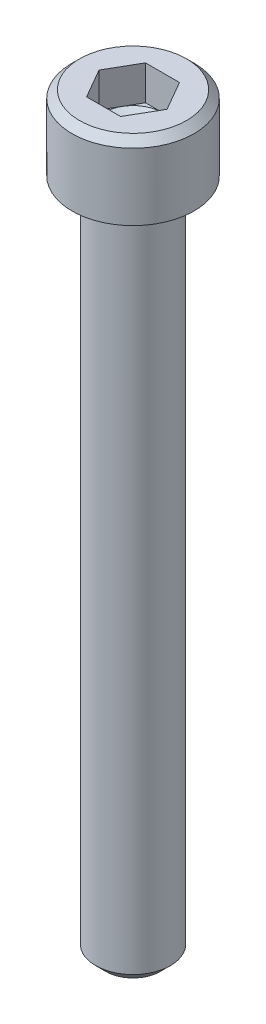
ISO-10303-21;
HEADER;
FILE_DESCRIPTION(('STEP AP214'),'2;1');
FILE_NAME('part.step','',(''),(''),'','','');
FILE_SCHEMA(('AUTOMOTIVE_DESIGN { 1 0 10303 214 1 1 1 1 }'));
ENDSEC;
DATA;
#1=APPLICATION_CONTEXT('core data for automotive mechanical design processes');
#2=APPLICATION_PROTOCOL_DEFINITION('international standard','automotive_design',2000,#1);
#3=PRODUCT_CONTEXT('',#1,'mechanical');
#4=PRODUCT('Part','Part','',(#3));
#5=PRODUCT_RELATED_PRODUCT_CATEGORY('part','',(#4));
#6=PRODUCT_DEFINITION_FORMATION('','',#4);
#7=PRODUCT_DEFINITION_CONTEXT('part definition',#1,'design');
#8=PRODUCT_DEFINITION('design','',#6,#7);
#9=PRODUCT_DEFINITION_SHAPE('','',#8);
#10=(LENGTH_UNIT() NAMED_UNIT(*) SI_UNIT(.MILLI.,.METRE.));
#11=(NAMED_UNIT(*) PLANE_ANGLE_UNIT() SI_UNIT($,.RADIAN.));
#12=(NAMED_UNIT(*) SI_UNIT($,.STERADIAN.) SOLID_ANGLE_UNIT());
#13=UNCERTAINTY_MEASURE_WITH_UNIT(LENGTH_MEASURE(1.E-05),#10,'distance_accuracy_value','');
#14=(GEOMETRIC_REPRESENTATION_CONTEXT(3) GLOBAL_UNCERTAINTY_ASSIGNED_CONTEXT((#13)) GLOBAL_UNIT_ASSIGNED_CONTEXT((#10,
#11,#12)) REPRESENTATION_CONTEXT('',''));
#15=CARTESIAN_POINT('',(0.,0.,0.));
#16=DIRECTION('',(0.,0.,1.));
#17=DIRECTION('',(1.,0.,0.));
#18=AXIS2_PLACEMENT_3D('',#15,#16,#17);
#19=CARTESIAN_POINT('',(0.,1.87960000005205,0.));
#20=DIRECTION('',(0.,1.,0.));
#21=DIRECTION('',(0.,0.,1.));
#22=AXIS2_PLACEMENT_3D('',#19,#20,#21);
#23=CONICAL_SURFACE('',#22,1.38430000009748,1.04719755120119);
#24=CARTESIAN_POINT('',(0.,1.08037402233663,5.6843418860808E-11));
#25=VERTEX_POINT('',#24);
#26=VERTEX_LOOP('',#25);
#27=FACE_BOUND('',#26,.T.);
#28=CARTESIAN_POINT('',(0.,1.87959999992078,0.));
#29=DIRECTION('',(0.,1.,0.));
#30=DIRECTION('',(0.,0.,1.));
#31=AXIS2_PLACEMENT_3D('',#28,#29,#30);
#32=CIRCLE('',#31,1.38429999987011);
#33=CARTESIAN_POINT('',(0.,1.87959999996039,-1.38429999993505));
#34=VERTEX_POINT('',#33);
#35=CARTESIAN_POINT('',(1.1988389664588,1.87959999996039,-0.692149999999999));
#36=VERTEX_POINT('',#35);
#37=EDGE_CURVE('E120',#34,#36,#32,.F.);
#38=ORIENTED_EDGE('',*,*,#37,.F.);
#39=CARTESIAN_POINT('',(0.,1.87959999998641,0.));
#40=DIRECTION('',(0.,1.,0.));
#41=DIRECTION('',(0.,0.,1.));
#42=AXIS2_PLACEMENT_3D('',#39,#40,#41);
#43=CIRCLE('',#42,1.3842999999838);
#44=CARTESIAN_POINT('',(-1.19883896645178,1.87959999999321,-0.692149999995952));
#45=VERTEX_POINT('',#44);
#46=EDGE_CURVE('E158',#45,#34,#43,.F.);
#47=ORIENTED_EDGE('',*,*,#46,.F.);
#48=CARTESIAN_POINT('',(0.,1.87959999998641,0.));
#49=DIRECTION('',(0.,1.,0.));
#50=DIRECTION('',(0.,0.,1.));
#51=AXIS2_PLACEMENT_3D('',#48,#49,#50);
#52=CIRCLE('',#51,1.3842999999838);
#53=CARTESIAN_POINT('',(-1.19883896645178,1.87960000001923,0.692149999995948));
#54=VERTEX_POINT('',#53);
#55=EDGE_CURVE('E155',#54,#45,#52,.F.);
#56=ORIENTED_EDGE('',*,*,#55,.F.);
#57=CARTESIAN_POINT('',(0.,1.87960000005205,0.));
#58=DIRECTION('',(0.,1.,0.));
#59=DIRECTION('',(0.,0.,1.));
#60=AXIS2_PLACEMENT_3D('',#57,#58,#59);
#61=CIRCLE('',#60,1.38430000009748);
#62=CARTESIAN_POINT('',(0.,1.87960000001923,1.38430000004064));
#63=VERTEX_POINT('',#62);
#64=EDGE_CURVE('E99',#63,#54,#61,.F.);
#65=ORIENTED_EDGE('',*,*,#64,.F.);
#66=CARTESIAN_POINT('',(0.,1.87959999998641,0.));
#67=DIRECTION('',(0.,1.,0.));
#68=DIRECTION('',(0.,0.,1.));
#69=AXIS2_PLACEMENT_3D('',#66,#67,#68);
#70=CIRCLE('',#69,1.3842999999838);
#71=CARTESIAN_POINT('',(1.19883896645178,1.87959999999321,0.692149999995949));
#72=VERTEX_POINT('',#71);
#73=EDGE_CURVE('E93',#72,#63,#70,.F.);
#74=ORIENTED_EDGE('',*,*,#73,.F.);
#75=CARTESIAN_POINT('',(0.,1.87959999998641,0.));
#76=DIRECTION('',(0.,1.,0.));
#77=DIRECTION('',(0.,0.,1.));
#78=AXIS2_PLACEMENT_3D('',#75,#76,#77);
#79=CIRCLE('',#78,1.3842999999838);
#80=EDGE_CURVE('E96',#36,#72,#79,.F.);
#81=ORIENTED_EDGE('',*,*,#80,.F.);
#82=EDGE_LOOP('',(#38,#47,#56,#65,#74,#81));
#83=FACE_BOUND('',#82,.T.);
#84=ADVANCED_FACE('F15',(#27,#83),#23,.F.);
#85=CARTESIAN_POINT('',(0.,1.8796,0.));
#86=DIRECTION('',(0.,1.,0.));
#87=DIRECTION('',(0.,0.,1.));
#88=AXIS2_PLACEMENT_3D('',#85,#86,#87);
#89=PLANE('',#88);
#90=DIRECTION('',(0.500000000000001,0.,-0.866025403784438));
#91=VECTOR('',#90,1.);
#92=CARTESIAN_POINT('',(0.799225977639198,1.8796,1.3843));
#93=LINE('',#92,#91);
#94=CARTESIAN_POINT('',(0.799225977639198,1.8796,1.3843));
#95=VERTEX_POINT('',#94);
#96=EDGE_CURVE('E105',#95,#72,#93,.T.);
#97=ORIENTED_EDGE('',*,*,#96,.T.);
#98=ORIENTED_EDGE('',*,*,#73,.T.);
#99=DIRECTION('',(1.,0.,0.));
#100=VECTOR('',#99,1.);
#101=CARTESIAN_POINT('',(-0.799225977639198,1.8796,1.3843));
#102=LINE('',#101,#100);
#103=EDGE_CURVE('E107',#63,#95,#102,.T.);
#104=ORIENTED_EDGE('',*,*,#103,.T.);
#105=EDGE_LOOP('',(#97,#98,#104));
#106=FACE_BOUND('',#105,.T.);
#107=ADVANCED_FACE('F106',(#106),#89,.T.);
#108=CARTESIAN_POINT('',(0.,1.8796,0.));
#109=DIRECTION('',(0.,1.,0.));
#110=DIRECTION('',(0.,0.,1.));
#111=AXIS2_PLACEMENT_3D('',#108,#109,#110);
#112=PLANE('',#111);
#113=DIRECTION('',(-0.499999999999999,0.,-0.866025403784439));
#114=VECTOR('',#113,1.);
#115=CARTESIAN_POINT('',(1.5984519552784,1.8796,0.));
#116=LINE('',#115,#114);
#117=CARTESIAN_POINT('',(1.5984519552784,1.8796,0.));
#118=VERTEX_POINT('',#117);
#119=EDGE_CURVE('E118',#118,#36,#116,.T.);
#120=ORIENTED_EDGE('',*,*,#119,.T.);
#121=ORIENTED_EDGE('',*,*,#80,.T.);
#122=DIRECTION('',(0.500000000000001,0.,-0.866025403784438));
#123=VECTOR('',#122,1.);
#124=CARTESIAN_POINT('',(0.799225977639198,1.8796,1.3843));
#125=LINE('',#124,#123);
#126=EDGE_CURVE('E112',#72,#118,#125,.T.);
#127=ORIENTED_EDGE('',*,*,#126,.T.);
#128=EDGE_LOOP('',(#120,#121,#127));
#129=FACE_BOUND('',#128,.T.);
#130=ADVANCED_FACE('F115',(#129),#112,.T.);
#131=CARTESIAN_POINT('',(0.,1.8796,0.));
#132=DIRECTION('',(0.,1.,0.));
#133=DIRECTION('',(0.,0.,1.));
#134=AXIS2_PLACEMENT_3D('',#131,#132,#133);
#135=PLANE('',#134);
#136=DIRECTION('',(-1.,0.,0.));
#137=VECTOR('',#136,1.);
#138=CARTESIAN_POINT('',(0.799225977639201,1.8796,-1.3843));
#139=LINE('',#138,#137);
#140=CARTESIAN_POINT('',(0.799225977639201,1.8796,-1.3843));
#141=VERTEX_POINT('',#140);
#142=EDGE_CURVE('E168',#141,#34,#139,.T.);
#143=ORIENTED_EDGE('',*,*,#142,.T.);
#144=ORIENTED_EDGE('',*,*,#37,.T.);
#145=DIRECTION('',(-0.499999999999999,0.,-0.866025403784439));
#146=VECTOR('',#145,1.);
#147=CARTESIAN_POINT('',(1.5984519552784,1.8796,0.));
#148=LINE('',#147,#146);
#149=EDGE_CURVE('E165',#36,#141,#148,.T.);
#150=ORIENTED_EDGE('',*,*,#149,.T.);
#151=EDGE_LOOP('',(#143,#144,#150));
#152=FACE_BOUND('',#151,.T.);
#153=ADVANCED_FACE('F164',(#152),#135,.T.);
#154=CARTESIAN_POINT('',(0.,1.8796,0.));
#155=DIRECTION('',(0.,1.,0.));
#156=DIRECTION('',(0.,0.,1.));
#157=AXIS2_PLACEMENT_3D('',#154,#155,#156);
#158=PLANE('',#157);
#159=DIRECTION('',(-0.5,0.,0.866025403784438));
#160=VECTOR('',#159,1.);
#161=CARTESIAN_POINT('',(-0.799225977639195,1.8796,-1.3843));
#162=LINE('',#161,#160);
#163=CARTESIAN_POINT('',(-0.799225977639196,1.8796,-1.3843));
#164=VERTEX_POINT('',#163);
#165=EDGE_CURVE('E183',#164,#45,#162,.T.);
#166=ORIENTED_EDGE('',*,*,#165,.T.);
#167=ORIENTED_EDGE('',*,*,#46,.T.);
#168=DIRECTION('',(-1.,0.,0.));
#169=VECTOR('',#168,1.);
#170=CARTESIAN_POINT('',(0.799225977639201,1.8796,-1.3843));
#171=LINE('',#170,#169);
#172=EDGE_CURVE('E184',#34,#164,#171,.T.);
#173=ORIENTED_EDGE('',*,*,#172,.T.);
#174=EDGE_LOOP('',(#166,#167,#173));
#175=FACE_BOUND('',#174,.T.);
#176=ADVANCED_FACE('F328',(#175),#158,.T.);
#177=CARTESIAN_POINT('',(0.,1.8796,0.));
#178=DIRECTION('',(0.,1.,0.));
#179=DIRECTION('',(0.,0.,1.));
#180=AXIS2_PLACEMENT_3D('',#177,#178,#179);
#181=PLANE('',#180);
#182=DIRECTION('',(0.5,0.,0.866025403784439));
#183=VECTOR('',#182,1.);
#184=CARTESIAN_POINT('',(-1.5984519552784,1.8796,0.));
#185=LINE('',#184,#183);
#186=CARTESIAN_POINT('',(-1.5984519552784,1.8796,0.));
#187=VERTEX_POINT('',#186);
#188=EDGE_CURVE('E196',#187,#54,#185,.T.);
#189=ORIENTED_EDGE('',*,*,#188,.T.);
#190=ORIENTED_EDGE('',*,*,#55,.T.);
#191=DIRECTION('',(-0.5,0.,0.866025403784438));
#192=VECTOR('',#191,1.);
#193=CARTESIAN_POINT('',(-0.799225977639195,1.8796,-1.3843));
#194=LINE('',#193,#192);
#195=EDGE_CURVE('E197',#45,#187,#194,.T.);
#196=ORIENTED_EDGE('',*,*,#195,.T.);
#197=EDGE_LOOP('',(#189,#190,#196));
#198=FACE_BOUND('',#197,.T.);
#199=ADVANCED_FACE('F324',(#198),#181,.T.);
#200=CARTESIAN_POINT('',(0.,1.8796,0.));
#201=DIRECTION('',(0.,1.,0.));
#202=DIRECTION('',(0.,0.,1.));
#203=AXIS2_PLACEMENT_3D('',#200,#201,#202);
#204=PLANE('',#203);
#205=DIRECTION('',(1.,0.,0.));
#206=VECTOR('',#205,1.);
#207=CARTESIAN_POINT('',(-0.799225977639198,1.8796,1.3843));
#208=LINE('',#207,#206);
#209=CARTESIAN_POINT('',(-0.799225977639198,1.8796,1.3843));
#210=VERTEX_POINT('',#209);
#211=EDGE_CURVE('E139',#210,#63,#208,.T.);
#212=ORIENTED_EDGE('',*,*,#211,.T.);
#213=ORIENTED_EDGE('',*,*,#64,.T.);
#214=DIRECTION('',(0.5,0.,0.866025403784439));
#215=VECTOR('',#214,1.);
#216=CARTESIAN_POINT('',(-1.5984519552784,1.8796,0.));
#217=LINE('',#216,#215);
#218=EDGE_CURVE('E215',#54,#210,#217,.T.);
#219=ORIENTED_EDGE('',*,*,#218,.T.);
#220=EDGE_LOOP('',(#212,#213,#219));
#221=FACE_BOUND('',#220,.T.);
#222=ADVANCED_FACE('F320',(#221),#204,.T.);
#223=CARTESIAN_POINT('',(-0.799225977639198,3.5052,1.3843));
#224=DIRECTION('',(0.,0.,1.));
#225=DIRECTION('',(1.,0.,0.));
#226=AXIS2_PLACEMENT_3D('',#223,#224,#225);
#227=PLANE('',#226);
#228=DIRECTION('',(1.,0.,0.));
#229=VECTOR('',#228,1.);
#230=CARTESIAN_POINT('',(0.,3.5052,1.3843));
#231=LINE('',#230,#229);
#232=CARTESIAN_POINT('',(-0.799225977639198,3.5052,1.3843));
#233=VERTEX_POINT('',#232);
#234=CARTESIAN_POINT('',(0.799225977639198,3.5052,1.3843));
#235=VERTEX_POINT('',#234);
#236=EDGE_CURVE('E210',#233,#235,#231,.T.);
#237=ORIENTED_EDGE('',*,*,#236,.T.);
#238=DIRECTION('',(0.,1.,0.));
#239=VECTOR('',#238,1.);
#240=CARTESIAN_POINT('',(0.799225977639198,3.5052,1.3843));
#241=LINE('',#240,#239);
#242=EDGE_CURVE('E125',#235,#95,#241,.F.);
#243=ORIENTED_EDGE('',*,*,#242,.T.);
#244=ORIENTED_EDGE('',*,*,#103,.F.);
#245=ORIENTED_EDGE('',*,*,#211,.F.);
#246=DIRECTION('',(0.,1.,0.));
#247=VECTOR('',#246,1.);
#248=CARTESIAN_POINT('',(-0.799225977639198,3.5052,1.3843));
#249=LINE('',#248,#247);
#250=EDGE_CURVE('E211',#210,#233,#249,.T.);
#251=ORIENTED_EDGE('',*,*,#250,.T.);
#252=EDGE_LOOP('',(#237,#243,#244,#245,#251));
#253=FACE_BOUND('',#252,.T.);
#254=ADVANCED_FACE('F317',(#253),#227,.F.);
#255=CARTESIAN_POINT('',(0.799225977639198,3.5052,1.3843));
#256=DIRECTION('',(0.866025403784438,0.,0.500000000000001));
#257=DIRECTION('',(0.500000000000001,0.,-0.866025403784438));
#258=AXIS2_PLACEMENT_3D('',#255,#256,#257);
#259=PLANE('',#258);
#260=DIRECTION('',(0.500000000000001,0.,-0.866025403784438));
#261=VECTOR('',#260,1.);
#262=CARTESIAN_POINT('',(0.799225977639198,3.5052,1.3843));
#263=LINE('',#262,#261);
#264=CARTESIAN_POINT('',(1.5984519552784,3.5052,0.));
#265=VERTEX_POINT('',#264);
#266=EDGE_CURVE('E227',#235,#265,#263,.T.);
#267=ORIENTED_EDGE('',*,*,#266,.T.);
#268=DIRECTION('',(0.,1.,0.));
#269=VECTOR('',#268,1.);
#270=CARTESIAN_POINT('',(1.5984519552784,3.5052,0.));
#271=LINE('',#270,#269);
#272=EDGE_CURVE('E124',#265,#118,#271,.F.);
#273=ORIENTED_EDGE('',*,*,#272,.T.);
#274=ORIENTED_EDGE('',*,*,#126,.F.);
#275=ORIENTED_EDGE('',*,*,#96,.F.);
#276=ORIENTED_EDGE('',*,*,#242,.F.);
#277=EDGE_LOOP('',(#267,#273,#274,#275,#276));
#278=FACE_BOUND('',#277,.T.);
#279=ADVANCED_FACE('F122',(#278),#259,.F.);
#280=CARTESIAN_POINT('',(1.5984519552784,3.5052,0.));
#281=DIRECTION('',(0.866025403784439,0.,-0.499999999999999));
#282=DIRECTION('',(-0.499999999999999,0.,-0.866025403784439));
#283=AXIS2_PLACEMENT_3D('',#280,#281,#282);
#284=PLANE('',#283);
#285=DIRECTION('',(-0.499999999999999,0.,-0.866025403784439));
#286=VECTOR('',#285,1.);
#287=CARTESIAN_POINT('',(1.5984519552784,3.5052,0.));
#288=LINE('',#287,#286);
#289=CARTESIAN_POINT('',(0.799225977639201,3.5052,-1.3843));
#290=VERTEX_POINT('',#289);
#291=EDGE_CURVE('E229',#265,#290,#288,.T.);
#292=ORIENTED_EDGE('',*,*,#291,.T.);
#293=DIRECTION('',(0.,1.,0.));
#294=VECTOR('',#293,1.);
#295=CARTESIAN_POINT('',(0.799225977639201,3.5052,-1.3843));
#296=LINE('',#295,#294);
#297=EDGE_CURVE('E172',#290,#141,#296,.F.);
#298=ORIENTED_EDGE('',*,*,#297,.T.);
#299=ORIENTED_EDGE('',*,*,#149,.F.);
#300=ORIENTED_EDGE('',*,*,#119,.F.);
#301=ORIENTED_EDGE('',*,*,#272,.F.);
#302=EDGE_LOOP('',(#292,#298,#299,#300,#301));
#303=FACE_BOUND('',#302,.T.);
#304=ADVANCED_FACE('F170',(#303),#284,.F.);
#305=CARTESIAN_POINT('',(0.799225977639201,3.5052,-1.3843));
#306=DIRECTION('',(0.,0.,-1.));
#307=DIRECTION('',(-1.,0.,0.));
#308=AXIS2_PLACEMENT_3D('',#305,#306,#307);
#309=PLANE('',#308);
#310=DIRECTION('',(1.,0.,0.));
#311=VECTOR('',#310,1.);
#312=CARTESIAN_POINT('',(0.,3.5052,-1.3843));
#313=LINE('',#312,#311);
#314=CARTESIAN_POINT('',(-0.799225977639196,3.5052,-1.3843));
#315=VERTEX_POINT('',#314);
#316=EDGE_CURVE('E231',#290,#315,#313,.F.);
#317=ORIENTED_EDGE('',*,*,#316,.T.);
#318=DIRECTION('',(0.,1.,0.));
#319=VECTOR('',#318,1.);
#320=CARTESIAN_POINT('',(-0.799225977639195,3.5052,-1.3843));
#321=LINE('',#320,#319);
#322=EDGE_CURVE('E193',#315,#164,#321,.F.);
#323=ORIENTED_EDGE('',*,*,#322,.T.);
#324=ORIENTED_EDGE('',*,*,#172,.F.);
#325=ORIENTED_EDGE('',*,*,#142,.F.);
#326=ORIENTED_EDGE('',*,*,#297,.F.);
#327=EDGE_LOOP('',(#317,#323,#324,#325,#326));
#328=FACE_BOUND('',#327,.T.);
#329=ADVANCED_FACE('F308',(#328),#309,.F.);
#330=CARTESIAN_POINT('',(-0.799225977639195,3.5052,-1.3843));
#331=DIRECTION('',(-0.866025403784438,0.,-0.5));
#332=DIRECTION('',(-0.5,0.,0.866025403784438));
#333=AXIS2_PLACEMENT_3D('',#330,#331,#332);
#334=PLANE('',#333);
#335=DIRECTION('',(-0.500000000000002,0.,0.866025403784438));
#336=VECTOR('',#335,1.);
#337=CARTESIAN_POINT('',(-0.799225977639195,3.5052,-1.3843));
#338=LINE('',#337,#336);
#339=CARTESIAN_POINT('',(-1.5984519552784,3.5052,0.));
#340=VERTEX_POINT('',#339);
#341=EDGE_CURVE('E233',#315,#340,#338,.T.);
#342=ORIENTED_EDGE('',*,*,#341,.T.);
#343=DIRECTION('',(0.,1.,0.));
#344=VECTOR('',#343,1.);
#345=CARTESIAN_POINT('',(-1.5984519552784,3.5052,0.));
#346=LINE('',#345,#344);
#347=EDGE_CURVE('E207',#340,#187,#346,.F.);
#348=ORIENTED_EDGE('',*,*,#347,.T.);
#349=ORIENTED_EDGE('',*,*,#195,.F.);
#350=ORIENTED_EDGE('',*,*,#165,.F.);
#351=ORIENTED_EDGE('',*,*,#322,.F.);
#352=EDGE_LOOP('',(#342,#348,#349,#350,#351));
#353=FACE_BOUND('',#352,.T.);
#354=ADVANCED_FACE('F304',(#353),#334,.F.);
#355=CARTESIAN_POINT('',(-1.5984519552784,3.5052,0.));
#356=DIRECTION('',(-0.866025403784439,0.,0.5));
#357=DIRECTION('',(0.5,0.,0.866025403784439));
#358=AXIS2_PLACEMENT_3D('',#355,#356,#357);
#359=PLANE('',#358);
#360=DIRECTION('',(0.5,0.,0.866025403784439));
#361=VECTOR('',#360,1.);
#362=CARTESIAN_POINT('',(-1.5984519552784,3.5052,0.));
#363=LINE('',#362,#361);
#364=EDGE_CURVE('E153',#340,#233,#363,.T.);
#365=ORIENTED_EDGE('',*,*,#364,.T.);
#366=ORIENTED_EDGE('',*,*,#250,.F.);
#367=ORIENTED_EDGE('',*,*,#218,.F.);
#368=ORIENTED_EDGE('',*,*,#188,.F.);
#369=ORIENTED_EDGE('',*,*,#347,.F.);
#370=EDGE_LOOP('',(#365,#366,#367,#368,#369));
#371=FACE_BOUND('',#370,.T.);
#372=ADVANCED_FACE('F300',(#371),#359,.F.);
#373=CARTESIAN_POINT('',(0.,3.5052,0.));
#374=DIRECTION('',(0.,-1.,0.));
#375=DIRECTION('',(0.,0.,-1.));
#376=AXIS2_PLACEMENT_3D('',#373,#374,#375);
#377=PLANE('',#376);
#378=ORIENTED_EDGE('',*,*,#341,.F.);
#379=ORIENTED_EDGE('',*,*,#316,.F.);
#380=ORIENTED_EDGE('',*,*,#291,.F.);
#381=ORIENTED_EDGE('',*,*,#266,.F.);
#382=ORIENTED_EDGE('',*,*,#236,.F.);
#383=ORIENTED_EDGE('',*,*,#364,.F.);
#384=EDGE_LOOP('',(#378,#379,#380,#381,#382,#383));
#385=FACE_BOUND('',#384,.T.);
#386=CARTESIAN_POINT('',(0.,3.50520000046117,0.));
#387=DIRECTION('',(0.,-1.,0.));
#388=DIRECTION('',(1.,0.,0.));
#389=AXIS2_PLACEMENT_3D('',#386,#387,#388);
#390=CIRCLE('',#389,2.51459999952886);
#391=CARTESIAN_POINT('',(2.51459999952886,3.50520000046117,0.));
#392=VERTEX_POINT('',#391);
#393=EDGE_CURVE('E150',#392,#392,#390,.T.);
#394=ORIENTED_EDGE('',*,*,#393,.F.);
#395=EDGE_LOOP('',(#394));
#396=FACE_BOUND('',#395,.T.);
#397=ADVANCED_FACE('F296',(#385,#396),#377,.F.);
#398=CARTESIAN_POINT('',(0.,3.14960000099518,0.));
#399=DIRECTION('',(0.,-1.,0.));
#400=DIRECTION('',(1.,0.,0.));
#401=AXIS2_PLACEMENT_3D('',#398,#399,#400);
#402=CONICAL_SURFACE('',#401,2.87019999905169,0.785398163477374);
#403=CARTESIAN_POINT('',(0.,3.1496,0.));
#404=DIRECTION('',(0.,-1.,0.));
#405=DIRECTION('',(0.,0.,-1.));
#406=AXIS2_PLACEMENT_3D('',#403,#404,#405);
#407=CIRCLE('',#406,2.8702);
#408=CARTESIAN_POINT('',(0.,3.1496,-2.8702));
#409=VERTEX_POINT('',#408);
#410=EDGE_CURVE('E149',#409,#409,#407,.T.);
#411=ORIENTED_EDGE('',*,*,#410,.F.);
#412=EDGE_LOOP('',(#411));
#413=FACE_BOUND('',#412,.T.);
#414=ORIENTED_EDGE('',*,*,#393,.T.);
#415=EDGE_LOOP('',(#414));
#416=FACE_BOUND('',#415,.T.);
#417=ADVANCED_FACE('F292',(#413,#416),#402,.T.);
#418=CARTESIAN_POINT('',(0.,5.26796,0.));
#419=DIRECTION('',(0.,-1.,0.));
#420=DIRECTION('',(0.,0.,-1.));
#421=AXIS2_PLACEMENT_3D('',#418,#419,#420);
#422=CYLINDRICAL_SURFACE('',#421,2.8702);
#423=CARTESIAN_POINT('',(0.,0.,0.));
#424=DIRECTION('',(0.,-1.,0.));
#425=DIRECTION('',(0.,0.,-1.));
#426=AXIS2_PLACEMENT_3D('',#423,#424,#425);
#427=CIRCLE('',#426,2.8702);
#428=CARTESIAN_POINT('',(0.,0.,-2.8702));
#429=VERTEX_POINT('',#428);
#430=EDGE_CURVE('E146',#429,#429,#427,.T.);
#431=ORIENTED_EDGE('',*,*,#430,.F.);
#432=EDGE_LOOP('',(#431));
#433=FACE_BOUND('',#432,.T.);
#434=ORIENTED_EDGE('',*,*,#410,.T.);
#435=EDGE_LOOP('',(#434));
#436=FACE_BOUND('',#435,.T.);
#437=ADVANCED_FACE('F288',(#433,#436),#422,.T.);
#438=CARTESIAN_POINT('',(0.,-31.75,0.));
#439=DIRECTION('',(0.,-1.,0.));
#440=DIRECTION('',(0.,0.,-1.));
#441=AXIS2_PLACEMENT_3D('',#438,#439,#440);
#442=PLANE('',#441);
#443=CARTESIAN_POINT('',(0.,-31.7500000004429,0.));
#444=DIRECTION('',(0.,1.,0.));
#445=DIRECTION('',(0.,0.,1.));
#446=AXIS2_PLACEMENT_3D('',#443,#444,#445);
#447=CIRCLE('',#446,1.28015999951003);
#448=CARTESIAN_POINT('',(0.,-31.7500000004429,1.28015999951003));
#449=VERTEX_POINT('',#448);
#450=EDGE_CURVE('E142',#449,#449,#447,.T.);
#451=ORIENTED_EDGE('',*,*,#450,.F.);
#452=EDGE_LOOP('',(#451));
#453=FACE_BOUND('',#452,.T.);
#454=ADVANCED_FACE('F277',(#453),#442,.T.);
#455=CARTESIAN_POINT('',(0.,0.,0.));
#456=DIRECTION('',(0.,-1.,0.));
#457=DIRECTION('',(0.,0.,-1.));
#458=AXIS2_PLACEMENT_3D('',#455,#456,#457);
#459=PLANE('',#458);
#460=CARTESIAN_POINT('',(-2.0066,0.,0.));
#461=CARTESIAN_POINT('',(-2.00659444772704,-9.10920251746069E-11,-0.00407100060830671));
#462=CARTESIAN_POINT('',(-2.00657797802813,-2.003093424363E-10,-0.00814200376032817));
#463=CARTESIAN_POINT('',(-2.00649512070962,-5.5247872417031E-10,-0.0202447650283772));
#464=CARTESIAN_POINT('',(-2.00639575581035,-8.22157769920247E-10,-0.0282763152871072));
#465=CARTESIAN_POINT('',(-2.00602813580192,-1.41403875787932E-09,-0.0482979528213397));
#466=CARTESIAN_POINT('',(-2.00570075860637,-1.69655991107149E-09,-0.060286993677806));
#467=CARTESIAN_POINT('',(-2.00468907697452,-2.27312511183005E-09,-0.0882156651684228));
#468=CARTESIAN_POINT('',(-2.00392260146457,-2.54015983169479E-09,-0.104152356858792));
#469=CARTESIAN_POINT('',(-2.00177303812968,-3.01967053535053E-09,-0.139956779473427));
#470=CARTESIAN_POINT('',(-2.00028411091019,-3.20214406298518E-09,-0.159818213296924));
#471=CARTESIAN_POINT('',(-1.99636161242623,-3.48138847978809E-09,-0.203432998208972));
#472=CARTESIAN_POINT('',(-1.99379906406532,-3.55389821216279E-09,-0.227174809863206));
#473=CARTESIAN_POINT('',(-1.98733360091794,-3.59330489603519E-09,-0.278481864315499));
#474=CARTESIAN_POINT('',(-1.98327885927871,-3.5406880328213E-09,-0.30602806728915));
#475=CARTESIAN_POINT('',(-1.97336922120563,-3.33167996437363E-09,-0.364833482932043));
#476=CARTESIAN_POINT('',(-1.96734028851388,-3.16158989023882E-09,-0.396063394332171));
#477=CARTESIAN_POINT('',(-1.95296191110637,-2.73937755385804E-09,-0.462073573885272));
#478=CARTESIAN_POINT('',(-1.94441697813461,-2.47967705309348E-09,-0.496811612101975));
#479=CARTESIAN_POINT('',(-1.92982487950783,-2.06661086152197E-09,-0.549967795252686));
#480=CARTESIAN_POINT('',(-1.92442836719349,-1.91907423952635E-09,-0.56856722791368));
#481=CARTESIAN_POINT('',(-1.91280943161884,-1.62576533403984E-09,-0.606549618755739));
#482=CARTESIAN_POINT('',(-1.90655888625118,-1.48046904013077E-09,-0.625924009394066));
#483=CARTESIAN_POINT('',(-1.89315315416811,-1.17214628145328E-09,-0.665411328049921));
#484=CARTESIAN_POINT('',(-1.88596875147999,-1.00860114528708E-09,-0.685514333637841));
#485=CARTESIAN_POINT('',(-1.87061329048526,-7.8693317951882E-10,-0.726407683066616));
#486=CARTESIAN_POINT('',(-1.86241192223394,-7.34052866107973E-10,-0.747186650010526));
#487=CARTESIAN_POINT('',(-1.84473139469964,-2.86196079007449E-10,-0.789890551332406));
#488=CARTESIAN_POINT('',(-1.83520307402645,1.32227682311591E-10,-0.811795141643023));
#489=CARTESIAN_POINT('',(-1.81537902159719,-1.44431954778358E-10,-0.855254007871011));
#490=CARTESIAN_POINT('',(-1.80508329492679,-8.39507974518539E-10,-0.876808286108788));
#491=CARTESIAN_POINT('',(-1.78373556986437,-6.88178150616554E-09,-0.919539205396512));
#492=CARTESIAN_POINT('',(-1.77268356714419,-1.22290056443568E-08,-0.940715844284355));
#493=CARTESIAN_POINT('',(-1.74983877227449,-3.65929321239713E-08,-0.982666145213346));
#494=CARTESIAN_POINT('',(-1.73804596674059,-5.56098815067256E-08,-1.00343979996474));
#495=CARTESIAN_POINT('',(-1.71372862422445,-1.06598758902106E-07,-1.04455555645112));
#496=CARTESIAN_POINT('',(-1.70120406499356,-1.38571080992558E-07,-1.06489764503889));
#497=CARTESIAN_POINT('',(-1.68189524868349,-2.31473418255321E-07,-1.09507616724736));
#498=CARTESIAN_POINT('',(-1.67537174422661,-2.6993362698267E-07,-1.10508024853517));
#499=CARTESIAN_POINT('',(-1.66556815073239,-3.05517576621876E-07,-1.1197951452379));
#500=CARTESIAN_POINT('',(-1.66236347588782,-3.13735885170967E-07,-1.1245561919156));
#501=CARTESIAN_POINT('',(-1.64807685109538,-3.33132267583355E-07,-1.14556724471575));
#502=CARTESIAN_POINT('',(-1.63675506269745,-3.03076882473085E-07,-1.16165422227202));
#503=CARTESIAN_POINT('',(-1.60172573826511,-2.09572070581503E-07,-1.20989021241575));
#504=CARTESIAN_POINT('',(-1.57727808473419,-1.43627969141977E-07,-1.24150720791226));
#505=CARTESIAN_POINT('',(-1.53613848390108,-6.43416132628228E-08,-1.29154101259521));
#506=CARTESIAN_POINT('',(-1.52001124841488,-4.05374067088991E-08,-1.31042674581471));
#507=CARTESIAN_POINT('',(-1.48686832439961,-9.82813448591048E-09,-1.34781802741145));
#508=CARTESIAN_POINT('',(-1.4698441926306,-3.13293999420351E-09,-1.36631611894709));
#509=CARTESIAN_POINT('',(-1.44141867188755,4.07920806600388E-10,-1.39608008272162));
#510=CARTESIAN_POINT('',(-1.43021607442952,-5.57801982475024E-11,-1.40753690780757));
#511=CARTESIAN_POINT('',(-1.4019826005046,-5.55219287211281E-10,-1.435749994647));
#512=CARTESIAN_POINT('',(-1.38479091791133,-2.69013235227358E-10,-1.45234608959431));
#513=CARTESIAN_POINT('',(-1.3498295872115,7.96872882746289E-11,-1.4849168562696));
#514=CARTESIAN_POINT('',(-1.33205994796656,1.42185188202049E-10,-1.50089153751726));
#515=CARTESIAN_POINT('',(-1.29596841184034,-2.96455095878399E-09,-1.53220440404313));
#516=CARTESIAN_POINT('',(-1.2776465152857,-6.1337830942988E-09,-1.54754258969779));
#517=CARTESIAN_POINT('',(-1.24047303485071,-2.55562959245785E-08,-1.57756355647435));
#518=CARTESIAN_POINT('',(-1.22162144348335,-4.18097616490793E-08,-1.59224632832466));
#519=CARTESIAN_POINT('',(-1.18340806781203,-8.8448917207163E-08,-1.62093392534231));
#520=CARTESIAN_POINT('',(-1.16404626879284,-1.18835015070626E-07,-1.63493873092286));
#521=CARTESIAN_POINT('',(-1.13464994452412,-2.12219811060544E-07,-1.65543793529258));
#522=CARTESIAN_POINT('',(-1.12479188186516,-2.51317883822794E-07,-1.66218656278321));
#523=CARTESIAN_POINT('',(-1.11008886667321,-2.89043218768389E-07,-1.67204013334213));
#524=CARTESIAN_POINT('',(-1.10529436031567,-2.98143389371498E-07,-1.67522034540074));
#525=CARTESIAN_POINT('',(-1.08403791580151,-3.21178121027247E-07,-1.68917550893156));
#526=CARTESIAN_POINT('',(-1.06741609869001,-2.93528682678364E-07,-1.69970732621375));
#527=CARTESIAN_POINT('',(-1.02458251524103,-2.21508108820754E-07,-1.72596667847765));
#528=CARTESIAN_POINT('',(-0.998154485385933,-1.76351432338537E-07,-1.74134387629517));
#529=CARTESIAN_POINT('',(-0.963207684700409,-1.2102668307913E-07,-1.76061298731252));
#530=CARTESIAN_POINT('',(-0.954994432725908,-1.08334235323396E-07,-1.76506640169036));
#531=CARTESIAN_POINT('',(-0.924377674212358,-6.53210211006584E-08,-1.78139211262161));
#532=CARTESIAN_POINT('',(-0.901777517992145,-4.20668145944435E-08,-1.7928990677286));
#533=CARTESIAN_POINT('',(-0.856291086172353,-1.13431036302013E-08,-1.81498657939853));
#534=CARTESIAN_POINT('',(-0.833407223021334,-3.78303723167697E-09,-1.82557211139507));
#535=CARTESIAN_POINT('',(-0.796256259546503,3.04457677597182E-10,-1.84192706920787));
#536=CARTESIAN_POINT('',(-0.782106894296016,-1.65869211556916E-11,-1.84796559747399));
#537=CARTESIAN_POINT('',(-0.745812195728574,-4.62952024409152E-10,-1.86298055046484));
#538=CARTESIAN_POINT('',(-0.723574030068196,-3.81719577865555E-10,-1.87173405003251));
#539=CARTESIAN_POINT('',(-0.678801786128268,-1.86114451805943E-11,-1.88844605685296));
#540=CARTESIAN_POINT('',(-0.656267713327905,2.63260530930995E-10,-1.89640457880259));
#541=CARTESIAN_POINT('',(-0.610933113105901,-1.95147172371034E-09,-1.91152251116163));
#542=CARTESIAN_POINT('',(-0.588132586443401,-4.44806804035938E-09,-1.91868192384715));
#543=CARTESIAN_POINT('',(-0.542293127694566,-2.23570960131815E-08,-1.93219285312432));
#544=CARTESIAN_POINT('',(-0.519254192562048,-3.7769692900791E-08,-1.93854435937942));
#545=CARTESIAN_POINT('',(-0.47296449626933,-8.32622931844817E-08,-1.95042607552041));
#546=CARTESIAN_POINT('',(-0.449713729104971,-1.13342713601849E-07,-1.95595626204951));
#547=CARTESIAN_POINT('',(-0.414705339843896,-2.0760797241391E-07,-1.96364723793233));
#548=CARTESIAN_POINT('',(-0.403013425435919,-2.47222743586164E-07,-1.96611025487707));
#549=CARTESIAN_POINT('',(-0.385637033628878,-2.86138555059647E-07,-1.96959186610505));
#550=CARTESIAN_POINT('',(-0.379970331923911,-2.95693359061364E-07,-1.97069916132199));
#551=CARTESIAN_POINT('',(-0.354959225050909,-3.20404775776194E-07,-1.97546316244276));
#552=CARTESIAN_POINT('',(-0.335560061782903,-2.93579137589474E-07,-1.97883353828565));
#553=CARTESIAN_POINT('',(-0.285951147649189,-2.23149617280035E-07,-1.98669706673742));
#554=CARTESIAN_POINT('',(-0.255675929922258,-1.7844710244618E-07,-1.99078523696822));
#555=CARTESIAN_POINT('',(-0.216053573924741,-1.23284512078466E-07,-1.9952085021021));
#556=CARTESIAN_POINT('',(-0.206773700295921,-1.10603333470715E-07,-1.99617833598477));
#557=CARTESIAN_POINT('',(-0.171937384842274,-6.70719945062633E-08,-1.99957377147237));
#558=CARTESIAN_POINT('',(-0.146337800848078,-4.32965848788332E-08,-2.00157430934638));
#559=CARTESIAN_POINT('',(-0.0954963744179839,-1.18612321667215E-08,-2.00456982414633));
#560=CARTESIAN_POINT('',(-0.0702554503817128,-3.94660598362021E-09,-2.00558055707493));
#561=CARTESIAN_POINT('',(-0.0300059187095647,2.67233613208985E-10,-2.00644198915317));
#562=CARTESIAN_POINT('',(-0.0150031105959225,-2.25599864210617E-11,-2.00659704054143));
#563=CARTESIAN_POINT('',(0.0238977197997132,-5.16408263127084E-10,-2.00657774124629));
#564=CARTESIAN_POINT('',(0.0477962209674398,-5.67778778354345E-10,-2.00615360874627));
#565=CARTESIAN_POINT('',(0.0955622816286064,-1.61657483966258E-10,-2.00445782533498));
#566=CARTESIAN_POINT('',(0.119429841756377,2.95823722928072E-10,-2.00318619208292));
#567=CARTESIAN_POINT('',(0.167105287742981,-1.24957652995212E-09,-1.9998029053314));
#568=CARTESIAN_POINT('',(0.190913173869519,-3.25244693243153E-09,-1.99769125560716));
#569=CARTESIAN_POINT('',(0.23844002746439,-2.01663917760399E-08,-1.99263055807799));
#570=CARTESIAN_POINT('',(0.262158993875966,-3.50776191399576E-08,-1.98968150035271));
#571=CARTESIAN_POINT('',(0.30947835978246,-8.01416028974357E-08,-1.9829437374858));
#572=CARTESIAN_POINT('',(0.333078755916557,-1.10294788883435E-07,-1.97915500867983));
#573=CARTESIAN_POINT('',(0.368370314930344,-2.060213338152E-07,-1.97286326259785));
#574=CARTESIAN_POINT('',(0.38011640593753,-2.4634861251147E-07,-1.97066448386363));
#575=CARTESIAN_POINT('',(0.397530179483645,-2.86611312415212E-07,-1.96722632315794));
#576=CARTESIAN_POINT('',(0.403215332834743,-2.96653197024714E-07,-1.96607549220181));
#577=CARTESIAN_POINT('',(0.428187837722036,-3.23137706101266E-07,-1.96089614606049));
#578=CARTESIAN_POINT('',(0.447415973204096,-2.9722916729567E-07,-1.95658185640565));
#579=CARTESIAN_POINT('',(0.505297566709442,-2.13834958412892E-07,-1.94268748958055));
#580=CARTESIAN_POINT('',(0.543744194404671,-1.51112739736552E-07,-1.93222770121703));
#581=CARTESIAN_POINT('',(0.606724997769275,-7.11515118729665E-08,-1.91305546395557));
#582=CARTESIAN_POINT('',(0.631460761929755,-4.56826562496121E-08,-1.90499472145896));
#583=CARTESIAN_POINT('',(0.679938827511717,-1.24752334126141E-08,-1.88815133172681));
#584=CARTESIAN_POINT('',(0.703689909055896,-4.27599086352193E-09,-1.87939408931025));
#585=CARTESIAN_POINT('',(0.740866978620243,1.47201698339025E-10,-1.86489148414969));
#586=CARTESIAN_POINT('',(0.75440866082342,-2.93185270418351E-11,-1.85943994945679));
#587=CARTESIAN_POINT('',(0.789969141595903,-4.56704075794544E-10,-1.84468728804176));
#588=CARTESIAN_POINT('',(0.811889576262141,-6.83240888996844E-10,-1.83514726706584));
#589=CARTESIAN_POINT('',(0.85537744277299,-3.28116468161546E-10,-1.815296218266));
#590=CARTESIAN_POINT('',(0.876944882832365,2.53525931082521E-10,-1.80498520841544));
#591=CARTESIAN_POINT('',(0.919703219810872,-7.87096422152853E-10,-1.7836101596856));
#592=CARTESIAN_POINT('',(0.940894119071498,-2.4093474649968E-09,-1.77254612549101));
#593=CARTESIAN_POINT('',(0.98287337085061,-1.86561860636942E-08,-1.74967861718173));
#594=CARTESIAN_POINT('',(1.00366171899383,-3.32809148603783E-08,-1.737875135036));
#595=CARTESIAN_POINT('',(1.04480764235328,-7.84887615396712E-08,-1.71353796616567));
#596=CARTESIAN_POINT('',(1.0651652055156,-1.09072325357443E-07,-1.70100425904519));
#597=CARTESIAN_POINT('',(1.09536801740507,-2.07105481953384E-07,-1.68168326773853));
#598=CARTESIAN_POINT('',(1.10538037950813,-2.48478546371797E-07,-1.67515595967795));
#599=CARTESIAN_POINT('',(1.12018933321916,-2.9056687125391E-07,-1.66529173893099));
#600=CARTESIAN_POINT('',(1.12503574596238,-3.01254568206295E-07,-1.66202964487341));
#601=CARTESIAN_POINT('',(1.14618082285205,-3.2978790523367E-07,-1.64764859087565));
#602=CARTESIAN_POINT('',(1.16231492431865,-3.04247145538333E-07,-1.63628756070745));
#603=CARTESIAN_POINT('',(1.21043171967319,-2.21183927716675E-07,-1.60132180255652));
#604=CARTESIAN_POINT('',(1.2418893443022,-1.57500596858214E-07,-1.57698750541947));
#605=CARTESIAN_POINT('',(1.29307501619069,-7.48296166146684E-08,-1.53489409596897));
#606=CARTESIAN_POINT('',(1.3132231412617,-4.80206934364849E-08,-1.51764131105577));
#607=CARTESIAN_POINT('',(1.35197787363522,-1.31806173466161E-08,-1.48310536225981));
#608=CARTESIAN_POINT('',(1.3706135690282,-4.39664063328807E-09,-1.46585494267276));
#609=CARTESIAN_POINT('',(1.3990060277076,1.30448931826947E-10,-1.43856475118223));
#610=CARTESIAN_POINT('',(1.40899376973172,-4.28106735852833E-11,-1.42876371627319));
#611=CARTESIAN_POINT('',(1.43577971678923,-6.20772319306357E-10,-1.40194340820076));
#612=CARTESIAN_POINT('',(1.45238689613969,-1.10247467629945E-09,-1.38473228582256));
#613=CARTESIAN_POINT('',(1.4849800197538,-7.61696931133873E-10,-1.34973302446386));
#614=CARTESIAN_POINT('',(1.50096598150622,6.07464289099082E-11,-1.33194490175321));
#615=CARTESIAN_POINT('',(1.53230197356777,-1.45260083653439E-10,-1.29581728836126));
#616=CARTESIAN_POINT('',(1.54765200998018,-1.17369218833848E-09,-1.27747780297455));
#617=CARTESIAN_POINT('',(1.57769735153731,-1.69092572411442E-08,-1.24026991274943));
#618=CARTESIAN_POINT('',(1.59239265080618,-3.16165129218737E-08,-1.22140150316675));
#619=CARTESIAN_POINT('',(1.62110599813717,-7.90483090720718E-08,-1.18315503599528));
#620=CARTESIAN_POINT('',(1.63512402753475,-1.11773345776705E-07,-1.16377696438367));
#621=CARTESIAN_POINT('',(1.65564399871547,-2.17512344743103E-07,-1.13435679918615));
#622=CARTESIAN_POINT('',(1.66239970795047,-2.62203179169567E-07,-1.12449087772266));
#623=CARTESIAN_POINT('',(1.67237850890054,-3.09680437317642E-07,-1.10960458046447));
#624=CARTESIAN_POINT('',(1.67567531002195,-3.22243133044911E-07,-1.1046336310301));
#625=CARTESIAN_POINT('',(1.68981495981925,-3.56382586804852E-07,-1.08308366862286));
#626=CARTESIAN_POINT('',(1.70041108479498,-3.31198253298226E-07,-1.06634267051712));
#627=CARTESIAN_POINT('',(1.73139697843105,-2.46914754602201E-07,-1.01572584904635));
#628=CARTESIAN_POINT('',(1.75103407595939,-1.79013380886279E-07,-0.981384793639759));
#629=CARTESIAN_POINT('',(1.78296003198758,-8.6243162053796E-08,-0.921495722849371));
#630=CARTESIAN_POINT('',(1.79575399389962,-5.46321674073477E-08,-0.89621451028532));
#631=CARTESIAN_POINT('',(1.81911749120246,-1.45633762981649E-08,-0.847521009320695));
#632=CARTESIAN_POINT('',(1.82978316203023,-4.21706298892906E-09,-0.824154998492323));
#633=CARTESIAN_POINT('',(1.84471629805608,1.29855375812166E-10,-0.789711973776931));
#634=CARTESIAN_POINT('',(1.84933862531656,-6.99618897743025E-11,-0.778787284528633));
#635=CARTESIAN_POINT('',(1.86296892935512,-1.41661206762857E-09,-0.745791877844936));
#636=CARTESIAN_POINT('',(1.87169343869526,-3.31584874057627E-09,-0.723602956810116));
#637=CARTESIAN_POINT('',(1.88834789024786,-5.62978218564014E-09,-0.678929843767657));
#638=CARTESIAN_POINT('',(1.89627784518035,-6.04450272710163E-09,-0.656445656493462));
#639=CARTESIAN_POINT('',(1.91134178333569,-5.01118939948541E-09,-0.611212162777673));
#640=CARTESIAN_POINT('',(1.91847576883155,-3.56316084991287E-09,-0.58846285709337));
#641=CARTESIAN_POINT('',(1.93193572284029,-5.15279667580763E-10,-0.542726303537178));
#642=CARTESIAN_POINT('',(1.93826168302971,1.08457452883752E-09,-0.51973905321686));
#643=CARTESIAN_POINT('',(1.95027237644954,-1.98464108811602E-09,-0.472893401749801));
#644=CARTESIAN_POINT('',(1.95593348777554,-6.83499785171836E-09,-0.449028936541931));
#645=CARTESIAN_POINT('',(1.96608557552663,-2.47591741648923E-08,-0.402428990299128));
#646=CARTESIAN_POINT('',(1.97062385949703,-3.73648295554368E-08,-0.379703810826946));
#647=CARTESIAN_POINT('',(1.97901489021879,-5.33047440951798E-08,-0.33343349351696));
#648=CARTESIAN_POINT('',(1.9828434379667,-5.63542516127815E-08,-0.309883957831886));
#649=CARTESIAN_POINT('',(1.98964108521314,-5.23930100552413E-08,-0.262662117470277));
#650=CARTESIAN_POINT('',(1.99261020773106,-4.53825304630174E-08,-0.238989816099265));
#651=CARTESIAN_POINT('',(1.99769305796779,-2.28968820766858E-08,-0.191554249195794));
#652=CARTESIAN_POINT('',(1.99980682913616,-7.42214333813385E-09,-0.167790988345748));
#653=CARTESIAN_POINT('',(2.00323826495521,-1.50077022732957E-09,-0.118839778603148));
#654=CARTESIAN_POINT('',(2.00450338888646,-1.25386333479788E-08,-0.0936481963727385));
#655=CARTESIAN_POINT('',(2.00609417557889,-2.16833588242237E-08,-0.0456349747892674));
#656=CARTESIAN_POINT('',(2.00649778473097,-2.09208369425267E-08,-0.0228159443223086));
#657=CARTESIAN_POINT('',(2.0066,0.,0.));
#658=B_SPLINE_CURVE_WITH_KNOTS('',3,(#460,#461,#462,#463,#464,#465,#466,#467,#468,#469,#470,
#471,#472,#473,#474,#475,#476,#477,#478,#479,#480,#481,#482,#483,#484,#485,#486,#487,#488,#489,
#490,#491,#492,#493,#494,#495,#496,#497,#498,#499,#500,#501,#502,#503,#504,#505,#506,#507,#508,
#509,#510,#511,#512,#513,#514,#515,#516,#517,#518,#519,#520,#521,#522,#523,#524,#525,#526,#527,
#528,#529,#530,#531,#532,#533,#534,#535,#536,#537,#538,#539,#540,#541,#542,#543,#544,#545,#546,
#547,#548,#549,#550,#551,#552,#553,#554,#555,#556,#557,#558,#559,#560,#561,#562,#563,#564,#565,
#566,#567,#568,#569,#570,#571,#572,#573,#574,#575,#576,#577,#578,#579,#580,#581,#582,#583,#584,
#585,#586,#587,#588,#589,#590,#591,#592,#593,#594,#595,#596,#597,#598,#599,#600,#601,#602,#603,
#604,#605,#606,#607,#608,#609,#610,#611,#612,#613,#614,#615,#616,#617,#618,#619,#620,#621,#622,
#623,#624,#625,#626,#627,#628,#629,#630,#631,#632,#633,#634,#635,#636,#637,#638,#639,#640,#641,
#642,#643,#644,#645,#646,#647,#648,#649,#650,#651,#652,#653,#654,#655,#656,#657),.UNSPECIFIED.,
.F.,.F.,(4,2,2,2,2,2,2,2,2,2,2,2,2,2,2,2,2,2,2,2,2,2,2,2,2,2,2,2,2,2,2,2,2,2,2,2,2,2,2,2,2,2,2,
2,2,2,2,2,2,2,2,2,2,2,2,2,2,2,2,2,2,2,2,2,2,2,2,2,2,2,2,2,2,2,2,2,2,2,2,2,2,2,2,2,2,2,2,2,2,2,2,
2,2,2,2,2,2,2,4),(0.,0.0122130369635573,0.0363090064776689,0.072287603246701,0.120148455524115,
0.17989112690197,0.251515116617727,0.335019859644009,0.430404726723355,0.53766902438434,
0.595761793548445,0.656825112714976,0.720858977518907,0.787863384465289,0.859509992078867,
0.931156124924142,1.00280266783436,1.07445050558424,1.14610052288885,1.18192802530605,
1.1991451323497,1.25815201251499,1.3779678855533,1.45245774815904,1.52785706311744,
1.57592459246845,1.64759463043442,1.71926357002611,1.79093246722941,1.862602377951,
1.9342743580168,1.97011285010219,1.98737266168736,2.04639636843877,2.1380861866397,
2.16611469144966,2.24217720402952,2.31779956913322,2.36394857896747,2.43562965240031,
2.50730940041135,2.57898894425251,2.65066940508765,2.72235190399074,2.758195662819,
2.77551703959651,2.83457751856423,2.92618904649581,2.95418000060653,3.03119178797937,
3.10695672634716,3.15196473935457,3.2236557276995,3.29534522227861,3.36703439467247,
3.43872441636561,3.51041645874449,3.5462649975701,3.56366612458911,3.62277649992212,
3.7422263135885,3.82025781928964,3.89617997250377,3.93997102807609,4.01167440288885,
4.08337610666678,4.15507736441602,4.22677940103749,4.29848344132475,4.33433798851992,
4.35186372111153,4.41105372611869,4.53028527380532,4.60984420464582,4.68600648324325,
4.72798463366101,4.79971955808762,4.87145246153914,4.94318467637716,5.01491753483535,
5.08665236901671,5.12252233482116,5.14041654845843,5.19984576278732,5.31844343130527,
5.40342352852472,5.48045776962209,5.51604367344725,5.58755507205711,5.65906532565636,
5.73057537504222,5.80208616099301,5.87564988039803,5.94515750376664,6.01671751310443,
6.08827560555706,6.1598300625944,6.23548346618154,6.30393731272861),.UNSPECIFIED.);
#659=CARTESIAN_POINT('',(2.00659999995536,0.,8.85811292639166E-10));
#660=VERTEX_POINT('',#659);
#661=CARTESIAN_POINT('',(-2.00659999995536,0.,-4.24476037352053E-10));
#662=VERTEX_POINT('',#661);
#663=EDGE_CURVE('E34',#660,#662,#658,.F.);
#664=ORIENTED_EDGE('',*,*,#663,.T.);
#665=CARTESIAN_POINT('',(0.,0.,0.));
#666=DIRECTION('',(0.,-1.,0.));
#667=DIRECTION('',(1.,0.,-3.06145077634602E-11));
#668=AXIS2_PLACEMENT_3D('',#665,#666,#667);
#669=CIRCLE('',#668,2.00659999992561);
#670=EDGE_CURVE('E145',#662,#660,#669,.F.);
#671=ORIENTED_EDGE('',*,*,#670,.T.);
#672=EDGE_LOOP('',(#664,#671));
#673=FACE_BOUND('',#672,.T.);
#674=ORIENTED_EDGE('',*,*,#430,.T.);
#675=EDGE_LOOP('',(#674));
#676=FACE_BOUND('',#675,.T.);
#677=ADVANCED_FACE('F268',(#673,#676),#459,.T.);
#678=CARTESIAN_POINT('',(0.,-31.2775600008308,0.));
#679=DIRECTION('',(0.,1.,0.));
#680=DIRECTION('',(0.,0.,1.));
#681=AXIS2_PLACEMENT_3D('',#678,#679,#680);
#682=CONICAL_SURFACE('',#681,1.75259999912214,0.785398163397448);
#683=ORIENTED_EDGE('',*,*,#450,.T.);
#684=EDGE_LOOP('',(#683));
#685=FACE_BOUND('',#684,.T.);
#686=CARTESIAN_POINT('',(0.,-31.27756,0.));
#687=DIRECTION('',(0.,-1.,0.));
#688=DIRECTION('',(0.,0.,-1.));
#689=AXIS2_PLACEMENT_3D('',#686,#687,#688);
#690=CIRCLE('',#689,1.7526);
#691=CARTESIAN_POINT('',(0.,-31.27756,-1.7526));
#692=VERTEX_POINT('',#691);
#693=EDGE_CURVE('E26',#692,#692,#690,.F.);
#694=ORIENTED_EDGE('',*,*,#693,.F.);
#695=EDGE_LOOP('',(#694));
#696=FACE_BOUND('',#695,.T.);
#697=ADVANCED_FACE('F257',(#685,#696),#682,.T.);
#698=CARTESIAN_POINT('',(0.,-0.254,0.));
#699=DIRECTION('',(0.,-1.,0.));
#700=DIRECTION('',(0.999418079576901,0.,-0.0341101482673352));
#701=AXIS2_PLACEMENT_3D('',#698,#699,#700);
#702=TOROIDAL_SURFACE('',#701,2.0066,0.254);
#703=CARTESIAN_POINT('',(0.,-0.254,0.));
#704=DIRECTION('',(0.,-1.,0.));
#705=DIRECTION('',(0.,0.,-1.));
#706=AXIS2_PLACEMENT_3D('',#703,#704,#705);
#707=CIRCLE('',#706,1.7526);
#708=CARTESIAN_POINT('',(0.,-0.254,-1.7526));
#709=VERTEX_POINT('',#708);
#710=EDGE_CURVE('E10',#709,#709,#707,.T.);
#711=ORIENTED_EDGE('',*,*,#710,.F.);
#712=EDGE_LOOP('',(#711));
#713=FACE_BOUND('',#712,.T.);
#714=ORIENTED_EDGE('',*,*,#670,.F.);
#715=ORIENTED_EDGE('',*,*,#663,.F.);
#716=EDGE_LOOP('',(#714,#715));
#717=FACE_BOUND('',#716,.T.);
#718=ADVANCED_FACE('F245',(#713,#717),#702,.F.);
#719=CARTESIAN_POINT('',(0.,5.26796,0.));
#720=DIRECTION('',(0.,-1.,0.));
#721=DIRECTION('',(0.,0.,-1.));
#722=AXIS2_PLACEMENT_3D('',#719,#720,#721);
#723=CYLINDRICAL_SURFACE('',#722,1.7526);
#724=ORIENTED_EDGE('',*,*,#693,.T.);
#725=EDGE_LOOP('',(#724));
#726=FACE_BOUND('',#725,.T.);
#727=ORIENTED_EDGE('',*,*,#710,.T.);
#728=EDGE_LOOP('',(#727));
#729=FACE_BOUND('',#728,.T.);
#730=ADVANCED_FACE('F256',(#726,#729),#723,.T.);
#731=CLOSED_SHELL('',(#84,#107,#130,#153,#176,#199,#222,#254,#279,#304,#329,#354,#372,#397,#417,
#437,#454,#677,#697,#718,#730));
#732=MANIFOLD_SOLID_BREP('B1',#731);
#733=ADVANCED_BREP_SHAPE_REPRESENTATION('',(#18,#732),#14);
#734=SHAPE_DEFINITION_REPRESENTATION(#9,#733);
ENDSEC;
END-ISO-10303-21;
